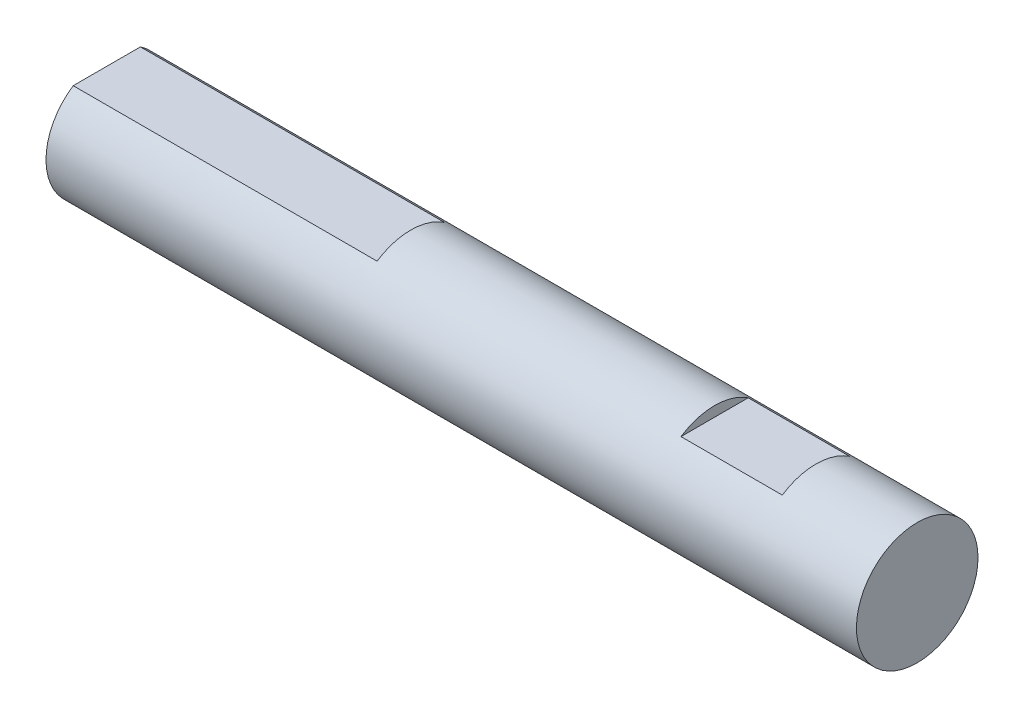
ISO-10303-21;
HEADER;
FILE_DESCRIPTION(('STEP AP214'),'2;1');
FILE_NAME('part.step','',(''),(''),'','','');
FILE_SCHEMA(('AUTOMOTIVE_DESIGN { 1 0 10303 214 1 1 1 1 }'));
ENDSEC;
DATA;
#1=APPLICATION_CONTEXT('core data for automotive mechanical design processes');
#2=APPLICATION_PROTOCOL_DEFINITION('international standard','automotive_design',2000,#1);
#3=PRODUCT_CONTEXT('',#1,'mechanical');
#4=PRODUCT('Part','Part','',(#3));
#5=PRODUCT_RELATED_PRODUCT_CATEGORY('part','',(#4));
#6=PRODUCT_DEFINITION_FORMATION('','',#4);
#7=PRODUCT_DEFINITION_CONTEXT('part definition',#1,'design');
#8=PRODUCT_DEFINITION('design','',#6,#7);
#9=PRODUCT_DEFINITION_SHAPE('','',#8);
#10=(LENGTH_UNIT() NAMED_UNIT(*) SI_UNIT(.MILLI.,.METRE.));
#11=(NAMED_UNIT(*) PLANE_ANGLE_UNIT() SI_UNIT($,.RADIAN.));
#12=(NAMED_UNIT(*) SI_UNIT($,.STERADIAN.) SOLID_ANGLE_UNIT());
#13=UNCERTAINTY_MEASURE_WITH_UNIT(LENGTH_MEASURE(1.E-05),#10,'distance_accuracy_value','');
#14=(GEOMETRIC_REPRESENTATION_CONTEXT(3) GLOBAL_UNCERTAINTY_ASSIGNED_CONTEXT((#13)) GLOBAL_UNIT_ASSIGNED_CONTEXT((#10,
#11,#12)) REPRESENTATION_CONTEXT('',''));
#15=CARTESIAN_POINT('',(0.,0.,0.));
#16=DIRECTION('',(0.,0.,1.));
#17=DIRECTION('',(1.,0.,0.));
#18=AXIS2_PLACEMENT_3D('',#15,#16,#17);
#19=CARTESIAN_POINT('',(70.,0.,0.));
#20=DIRECTION('',(-1.,0.,0.));
#21=DIRECTION('',(0.,0.,1.));
#22=AXIS2_PLACEMENT_3D('',#19,#20,#21);
#23=CYLINDRICAL_SURFACE('',#22,6.);
#24=CARTESIAN_POINT('',(60.,0.,0.));
#25=DIRECTION('',(1.,0.,0.));
#26=DIRECTION('',(0.,0.,-1.));
#27=AXIS2_PLACEMENT_3D('',#24,#25,#26);
#28=CIRCLE('',#27,6.);
#29=CARTESIAN_POINT('',(60.,5.,-3.3166247903554));
#30=VERTEX_POINT('',#29);
#31=CARTESIAN_POINT('',(60.,5.,3.3166247903554));
#32=VERTEX_POINT('',#31);
#33=EDGE_CURVE('E65',#30,#32,#28,.T.);
#34=ORIENTED_EDGE('',*,*,#33,.T.);
#35=DIRECTION('',(-1.,0.,0.));
#36=VECTOR('',#35,1.);
#37=CARTESIAN_POINT('',(70.,5.,3.3166247903554));
#38=LINE('',#37,#36);
#39=CARTESIAN_POINT('',(50.,5.,3.3166247903554));
#40=VERTEX_POINT('',#39);
#41=EDGE_CURVE('E51',#32,#40,#38,.T.);
#42=ORIENTED_EDGE('',*,*,#41,.T.);
#43=CARTESIAN_POINT('',(50.,0.,0.));
#44=DIRECTION('',(-1.,0.,0.));
#45=DIRECTION('',(0.,0.,1.));
#46=AXIS2_PLACEMENT_3D('',#43,#44,#45);
#47=CIRCLE('',#46,6.);
#48=CARTESIAN_POINT('',(50.,5.,-3.3166247903554));
#49=VERTEX_POINT('',#48);
#50=EDGE_CURVE('E125',#40,#49,#47,.T.);
#51=ORIENTED_EDGE('',*,*,#50,.T.);
#52=DIRECTION('',(-1.,0.,0.));
#53=VECTOR('',#52,1.);
#54=CARTESIAN_POINT('',(70.,5.,-3.3166247903554));
#55=LINE('',#54,#53);
#56=EDGE_CURVE('E120',#49,#30,#55,.F.);
#57=ORIENTED_EDGE('',*,*,#56,.T.);
#58=EDGE_LOOP('',(#34,#42,#51,#57));
#59=FACE_BOUND('',#58,.T.);
#60=CARTESIAN_POINT('',(70.,0.,0.));
#61=DIRECTION('',(1.,0.,0.));
#62=DIRECTION('',(0.,0.,-1.));
#63=AXIS2_PLACEMENT_3D('',#60,#61,#62);
#64=CIRCLE('',#63,6.);
#65=CARTESIAN_POINT('',(70.,0.,-6.));
#66=VERTEX_POINT('',#65);
#67=EDGE_CURVE('E93',#66,#66,#64,.T.);
#68=ORIENTED_EDGE('',*,*,#67,.F.);
#69=EDGE_LOOP('',(#68));
#70=FACE_BOUND('',#69,.T.);
#71=CARTESIAN_POINT('',(20.,0.,0.));
#72=DIRECTION('',(1.,0.,0.));
#73=DIRECTION('',(0.,0.,-1.));
#74=AXIS2_PLACEMENT_3D('',#71,#72,#73);
#75=CIRCLE('',#74,6.);
#76=CARTESIAN_POINT('',(20.,4.99999999999999,-3.31662479035541));
#77=VERTEX_POINT('',#76);
#78=CARTESIAN_POINT('',(20.,4.99999999999999,3.31662479035541));
#79=VERTEX_POINT('',#78);
#80=EDGE_CURVE('E11',#77,#79,#75,.T.);
#81=ORIENTED_EDGE('',*,*,#80,.T.);
#82=DIRECTION('',(-1.,0.,0.));
#83=VECTOR('',#82,1.);
#84=CARTESIAN_POINT('',(70.,5.,3.3166247903554));
#85=LINE('',#84,#83);
#86=CARTESIAN_POINT('',(-10.,4.99999999999999,3.31662479035541));
#87=VERTEX_POINT('',#86);
#88=EDGE_CURVE('E84',#79,#87,#85,.T.);
#89=ORIENTED_EDGE('',*,*,#88,.T.);
#90=CARTESIAN_POINT('',(-10.,0.,0.));
#91=DIRECTION('',(-1.,0.,0.));
#92=DIRECTION('',(0.,0.,1.));
#93=AXIS2_PLACEMENT_3D('',#90,#91,#92);
#94=CIRCLE('',#93,6.);
#95=CARTESIAN_POINT('',(-10.,4.99999999999999,-3.31662479035541));
#96=VERTEX_POINT('',#95);
#97=EDGE_CURVE('E88',#96,#87,#94,.T.);
#98=ORIENTED_EDGE('',*,*,#97,.F.);
#99=DIRECTION('',(-1.,0.,0.));
#100=VECTOR('',#99,1.);
#101=CARTESIAN_POINT('',(70.,5.,-3.3166247903554));
#102=LINE('',#101,#100);
#103=EDGE_CURVE('E94',#96,#77,#102,.F.);
#104=ORIENTED_EDGE('',*,*,#103,.T.);
#105=EDGE_LOOP('',(#81,#89,#98,#104));
#106=FACE_BOUND('',#105,.T.);
#107=ADVANCED_FACE('F43',(#59,#70,#106),#23,.T.);
#108=CARTESIAN_POINT('',(70.,0.,0.));
#109=DIRECTION('',(1.,0.,0.));
#110=DIRECTION('',(0.,0.,-1.));
#111=AXIS2_PLACEMENT_3D('',#108,#109,#110);
#112=PLANE('',#111);
#113=ORIENTED_EDGE('',*,*,#67,.T.);
#114=EDGE_LOOP('',(#113));
#115=FACE_BOUND('',#114,.T.);
#116=ADVANCED_FACE('F147',(#115),#112,.T.);
#117=CARTESIAN_POINT('',(20.,5.99999999999999,-35.));
#118=DIRECTION('',(1.,0.,0.));
#119=DIRECTION('',(0.,0.,-1.));
#120=AXIS2_PLACEMENT_3D('',#117,#118,#119);
#121=PLANE('',#120);
#122=DIRECTION('',(0.,0.,1.));
#123=VECTOR('',#122,1.);
#124=CARTESIAN_POINT('',(20.,4.99999999999999,-35.));
#125=LINE('',#124,#123);
#126=EDGE_CURVE('E106',#77,#79,#125,.T.);
#127=ORIENTED_EDGE('',*,*,#126,.T.);
#128=ORIENTED_EDGE('',*,*,#80,.F.);
#129=EDGE_LOOP('',(#127,#128));
#130=FACE_BOUND('',#129,.T.);
#131=ADVANCED_FACE('F143',(#130),#121,.F.);
#132=CARTESIAN_POINT('',(20.,4.99999999999999,-35.));
#133=DIRECTION('',(0.,-1.,0.));
#134=DIRECTION('',(1.,0.,0.));
#135=AXIS2_PLACEMENT_3D('',#132,#133,#134);
#136=PLANE('',#135);
#137=ORIENTED_EDGE('',*,*,#126,.F.);
#138=ORIENTED_EDGE('',*,*,#103,.F.);
#139=DIRECTION('',(0.,0.,-1.));
#140=VECTOR('',#139,1.);
#141=CARTESIAN_POINT('',(-10.,4.99999999999999,-3.31662479035541));
#142=LINE('',#141,#140);
#143=EDGE_CURVE('E97',#87,#96,#142,.T.);
#144=ORIENTED_EDGE('',*,*,#143,.F.);
#145=ORIENTED_EDGE('',*,*,#88,.F.);
#146=EDGE_LOOP('',(#137,#138,#144,#145));
#147=FACE_BOUND('',#146,.T.);
#148=ADVANCED_FACE('F98',(#147),#136,.F.);
#149=CARTESIAN_POINT('',(50.,6.,-35.));
#150=DIRECTION('',(-1.,0.,0.));
#151=DIRECTION('',(0.,0.,1.));
#152=AXIS2_PLACEMENT_3D('',#149,#150,#151);
#153=PLANE('',#152);
#154=DIRECTION('',(0.,0.,1.));
#155=VECTOR('',#154,1.);
#156=CARTESIAN_POINT('',(50.,5.,-35.));
#157=LINE('',#156,#155);
#158=EDGE_CURVE('E109',#49,#40,#157,.T.);
#159=ORIENTED_EDGE('',*,*,#158,.F.);
#160=ORIENTED_EDGE('',*,*,#50,.F.);
#161=EDGE_LOOP('',(#159,#160));
#162=FACE_BOUND('',#161,.T.);
#163=ADVANCED_FACE('F135',(#162),#153,.F.);
#164=CARTESIAN_POINT('',(60.,6.,-35.));
#165=DIRECTION('',(1.,0.,0.));
#166=DIRECTION('',(0.,0.,-1.));
#167=AXIS2_PLACEMENT_3D('',#164,#165,#166);
#168=PLANE('',#167);
#169=DIRECTION('',(0.,0.,1.));
#170=VECTOR('',#169,1.);
#171=CARTESIAN_POINT('',(60.,5.,-35.));
#172=LINE('',#171,#170);
#173=EDGE_CURVE('E58',#30,#32,#172,.T.);
#174=ORIENTED_EDGE('',*,*,#173,.T.);
#175=ORIENTED_EDGE('',*,*,#33,.F.);
#176=EDGE_LOOP('',(#174,#175));
#177=FACE_BOUND('',#176,.T.);
#178=ADVANCED_FACE('F133',(#177),#168,.F.);
#179=CARTESIAN_POINT('',(60.,5.,-35.));
#180=DIRECTION('',(0.,-1.,0.));
#181=DIRECTION('',(1.,0.,0.));
#182=AXIS2_PLACEMENT_3D('',#179,#180,#181);
#183=PLANE('',#182);
#184=ORIENTED_EDGE('',*,*,#173,.F.);
#185=ORIENTED_EDGE('',*,*,#56,.F.);
#186=ORIENTED_EDGE('',*,*,#158,.T.);
#187=ORIENTED_EDGE('',*,*,#41,.F.);
#188=EDGE_LOOP('',(#184,#185,#186,#187));
#189=FACE_BOUND('',#188,.T.);
#190=ADVANCED_FACE('F130',(#189),#183,.F.);
#191=CARTESIAN_POINT('',(-10.,0.,0.));
#192=DIRECTION('',(-1.,0.,0.));
#193=DIRECTION('',(0.,0.,1.));
#194=AXIS2_PLACEMENT_3D('',#191,#192,#193);
#195=PLANE('',#194);
#196=ORIENTED_EDGE('',*,*,#97,.T.);
#197=ORIENTED_EDGE('',*,*,#143,.T.);
#198=EDGE_LOOP('',(#196,#197));
#199=FACE_BOUND('',#198,.T.);
#200=ADVANCED_FACE('F102',(#199),#195,.T.);
#201=CLOSED_SHELL('',(#107,#116,#131,#148,#163,#178,#190,#200));
#202=MANIFOLD_SOLID_BREP('B2',#201);
#203=ADVANCED_BREP_SHAPE_REPRESENTATION('',(#18,#202),#14);
#204=SHAPE_DEFINITION_REPRESENTATION(#9,#203);
ENDSEC;
END-ISO-10303-21;
